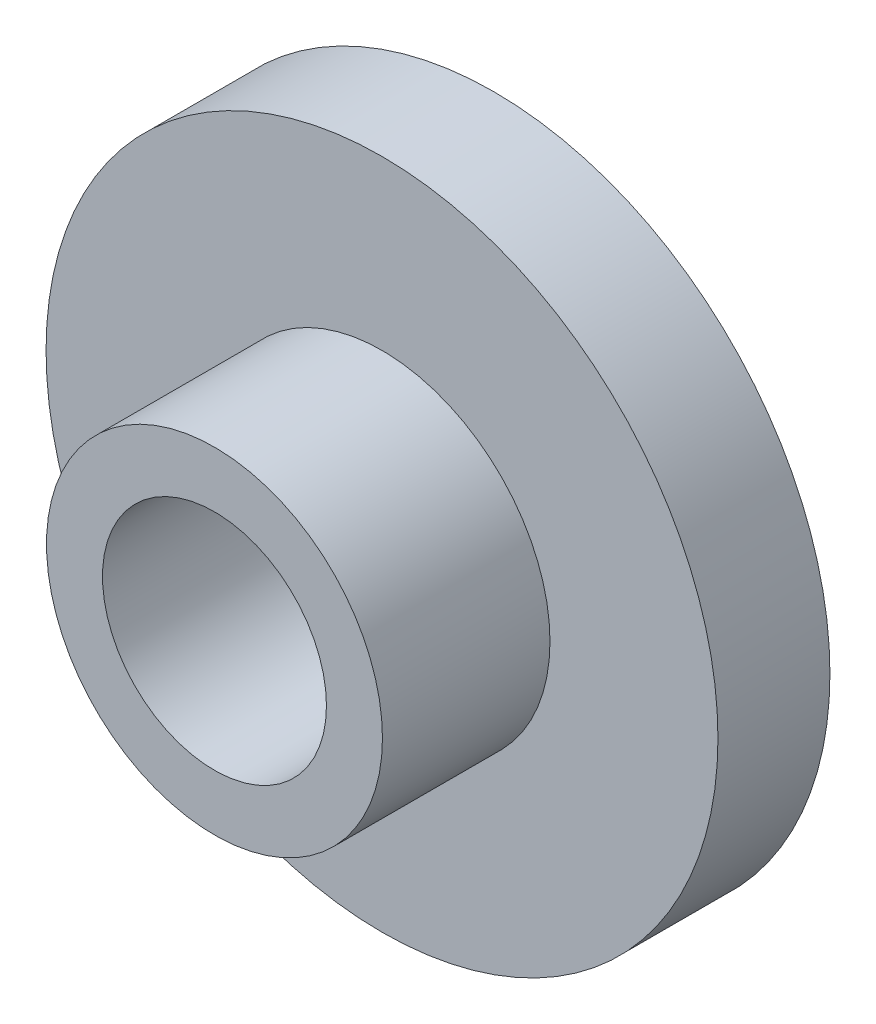
ISO-10303-21;
HEADER;
FILE_DESCRIPTION(('STEP AP214'),'2;1');
FILE_NAME('part.step','',(''),(''),'','','');
FILE_SCHEMA(('AUTOMOTIVE_DESIGN { 1 0 10303 214 1 1 1 1 }'));
ENDSEC;
DATA;
#1=APPLICATION_CONTEXT('core data for automotive mechanical design processes');
#2=APPLICATION_PROTOCOL_DEFINITION('international standard','automotive_design',2000,#1);
#3=PRODUCT_CONTEXT('',#1,'mechanical');
#4=PRODUCT('Part','Part','',(#3));
#5=PRODUCT_RELATED_PRODUCT_CATEGORY('part','',(#4));
#6=PRODUCT_DEFINITION_FORMATION('','',#4);
#7=PRODUCT_DEFINITION_CONTEXT('part definition',#1,'design');
#8=PRODUCT_DEFINITION('design','',#6,#7);
#9=PRODUCT_DEFINITION_SHAPE('','',#8);
#10=(LENGTH_UNIT() NAMED_UNIT(*) SI_UNIT(.MILLI.,.METRE.));
#11=(NAMED_UNIT(*) PLANE_ANGLE_UNIT() SI_UNIT($,.RADIAN.));
#12=(NAMED_UNIT(*) SI_UNIT($,.STERADIAN.) SOLID_ANGLE_UNIT());
#13=UNCERTAINTY_MEASURE_WITH_UNIT(LENGTH_MEASURE(1.E-05),#10,'distance_accuracy_value','');
#14=(GEOMETRIC_REPRESENTATION_CONTEXT(3) GLOBAL_UNCERTAINTY_ASSIGNED_CONTEXT((#13)) GLOBAL_UNIT_ASSIGNED_CONTEXT((#10,
#11,#12)) REPRESENTATION_CONTEXT('',''));
#15=CARTESIAN_POINT('',(0.,0.,0.));
#16=DIRECTION('',(0.,0.,1.));
#17=DIRECTION('',(1.,0.,0.));
#18=AXIS2_PLACEMENT_3D('',#15,#16,#17);
#19=CARTESIAN_POINT('',(0.,0.,3.175));
#20=DIRECTION('',(0.,0.,-1.));
#21=DIRECTION('',(-1.,0.,0.));
#22=AXIS2_PLACEMENT_3D('',#19,#20,#21);
#23=CYLINDRICAL_SURFACE('',#22,9.525);
#24=CARTESIAN_POINT('',(0.,0.,3.175));
#25=DIRECTION('',(0.,0.,1.));
#26=DIRECTION('',(1.,0.,0.));
#27=AXIS2_PLACEMENT_3D('',#24,#25,#26);
#28=CIRCLE('',#27,9.525);
#29=CARTESIAN_POINT('',(9.525,0.,3.175));
#30=VERTEX_POINT('',#29);
#31=EDGE_CURVE('E10',#30,#30,#28,.T.);
#32=ORIENTED_EDGE('',*,*,#31,.F.);
#33=EDGE_LOOP('',(#32));
#34=FACE_BOUND('',#33,.T.);
#35=CARTESIAN_POINT('',(0.,0.,0.));
#36=DIRECTION('',(0.,0.,1.));
#37=DIRECTION('',(1.,0.,0.));
#38=AXIS2_PLACEMENT_3D('',#35,#36,#37);
#39=CIRCLE('',#38,9.525);
#40=CARTESIAN_POINT('',(9.525,0.,0.));
#41=VERTEX_POINT('',#40);
#42=EDGE_CURVE('E33',#41,#41,#39,.T.);
#43=ORIENTED_EDGE('',*,*,#42,.T.);
#44=EDGE_LOOP('',(#43));
#45=FACE_BOUND('',#44,.T.);
#46=ADVANCED_FACE('F30',(#34,#45),#23,.T.);
#47=CARTESIAN_POINT('',(0.,0.,3.175));
#48=DIRECTION('',(0.,0.,1.));
#49=DIRECTION('',(1.,0.,0.));
#50=AXIS2_PLACEMENT_3D('',#47,#48,#49);
#51=PLANE('',#50);
#52=CARTESIAN_POINT('',(0.,0.,3.175));
#53=DIRECTION('',(0.,0.,1.));
#54=DIRECTION('',(1.,0.,0.));
#55=AXIS2_PLACEMENT_3D('',#52,#53,#54);
#56=CIRCLE('',#55,4.7625);
#57=CARTESIAN_POINT('',(4.7625,0.,3.175));
#58=VERTEX_POINT('',#57);
#59=EDGE_CURVE('E42',#58,#58,#56,.T.);
#60=ORIENTED_EDGE('',*,*,#59,.F.);
#61=EDGE_LOOP('',(#60));
#62=FACE_BOUND('',#61,.T.);
#63=ORIENTED_EDGE('',*,*,#31,.T.);
#64=EDGE_LOOP('',(#63));
#65=FACE_BOUND('',#64,.T.);
#66=ADVANCED_FACE('F70',(#62,#65),#51,.T.);
#67=CARTESIAN_POINT('',(0.,0.,0.));
#68=DIRECTION('',(0.,0.,1.));
#69=DIRECTION('',(1.,0.,0.));
#70=AXIS2_PLACEMENT_3D('',#67,#68,#69);
#71=PLANE('',#70);
#72=CARTESIAN_POINT('',(0.,0.,0.));
#73=DIRECTION('',(0.,0.,1.));
#74=DIRECTION('',(1.,0.,0.));
#75=AXIS2_PLACEMENT_3D('',#72,#73,#74);
#76=CIRCLE('',#75,3.175);
#77=CARTESIAN_POINT('',(3.175,0.,0.));
#78=VERTEX_POINT('',#77);
#79=EDGE_CURVE('E45',#78,#78,#76,.T.);
#80=ORIENTED_EDGE('',*,*,#79,.T.);
#81=EDGE_LOOP('',(#80));
#82=FACE_BOUND('',#81,.T.);
#83=ORIENTED_EDGE('',*,*,#42,.F.);
#84=EDGE_LOOP('',(#83));
#85=FACE_BOUND('',#84,.T.);
#86=ADVANCED_FACE('F66',(#82,#85),#71,.F.);
#87=CARTESIAN_POINT('',(0.,0.,7.9248));
#88=DIRECTION('',(0.,0.,-1.));
#89=DIRECTION('',(-1.,0.,0.));
#90=AXIS2_PLACEMENT_3D('',#87,#88,#89);
#91=CYLINDRICAL_SURFACE('',#90,4.7625);
#92=CARTESIAN_POINT('',(0.,0.,7.9248));
#93=DIRECTION('',(0.,0.,1.));
#94=DIRECTION('',(1.,0.,0.));
#95=AXIS2_PLACEMENT_3D('',#92,#93,#94);
#96=CIRCLE('',#95,4.7625);
#97=CARTESIAN_POINT('',(4.7625,0.,7.9248));
#98=VERTEX_POINT('',#97);
#99=EDGE_CURVE('E40',#98,#98,#96,.T.);
#100=ORIENTED_EDGE('',*,*,#99,.F.);
#101=EDGE_LOOP('',(#100));
#102=FACE_BOUND('',#101,.T.);
#103=ORIENTED_EDGE('',*,*,#59,.T.);
#104=EDGE_LOOP('',(#103));
#105=FACE_BOUND('',#104,.T.);
#106=ADVANCED_FACE('F60',(#102,#105),#91,.T.);
#107=CARTESIAN_POINT('',(0.,0.,7.9248));
#108=DIRECTION('',(0.,0.,1.));
#109=DIRECTION('',(1.,0.,0.));
#110=AXIS2_PLACEMENT_3D('',#107,#108,#109);
#111=PLANE('',#110);
#112=CARTESIAN_POINT('',(0.,0.,7.9248));
#113=DIRECTION('',(0.,0.,1.));
#114=DIRECTION('',(1.,0.,0.));
#115=AXIS2_PLACEMENT_3D('',#112,#113,#114);
#116=CIRCLE('',#115,3.175);
#117=CARTESIAN_POINT('',(3.175,0.,7.9248));
#118=VERTEX_POINT('',#117);
#119=EDGE_CURVE('E50',#118,#118,#116,.T.);
#120=ORIENTED_EDGE('',*,*,#119,.F.);
#121=EDGE_LOOP('',(#120));
#122=FACE_BOUND('',#121,.T.);
#123=ORIENTED_EDGE('',*,*,#99,.T.);
#124=EDGE_LOOP('',(#123));
#125=FACE_BOUND('',#124,.T.);
#126=ADVANCED_FACE('F57',(#122,#125),#111,.T.);
#127=CARTESIAN_POINT('',(0.,0.,-0.0508000000000002));
#128=DIRECTION('',(0.,0.,1.));
#129=DIRECTION('',(1.,0.,0.));
#130=AXIS2_PLACEMENT_3D('',#127,#128,#129);
#131=CYLINDRICAL_SURFACE('',#130,3.175);
#132=ORIENTED_EDGE('',*,*,#119,.T.);
#133=EDGE_LOOP('',(#132));
#134=FACE_BOUND('',#133,.T.);
#135=ORIENTED_EDGE('',*,*,#79,.F.);
#136=EDGE_LOOP('',(#135));
#137=FACE_BOUND('',#136,.T.);
#138=ADVANCED_FACE('F54',(#134,#137),#131,.F.);
#139=CLOSED_SHELL('',(#46,#66,#86,#106,#126,#138));
#140=MANIFOLD_SOLID_BREP('B2',#139);
#141=ADVANCED_BREP_SHAPE_REPRESENTATION('',(#18,#140),#14);
#142=SHAPE_DEFINITION_REPRESENTATION(#9,#141);
ENDSEC;
END-ISO-10303-21;
